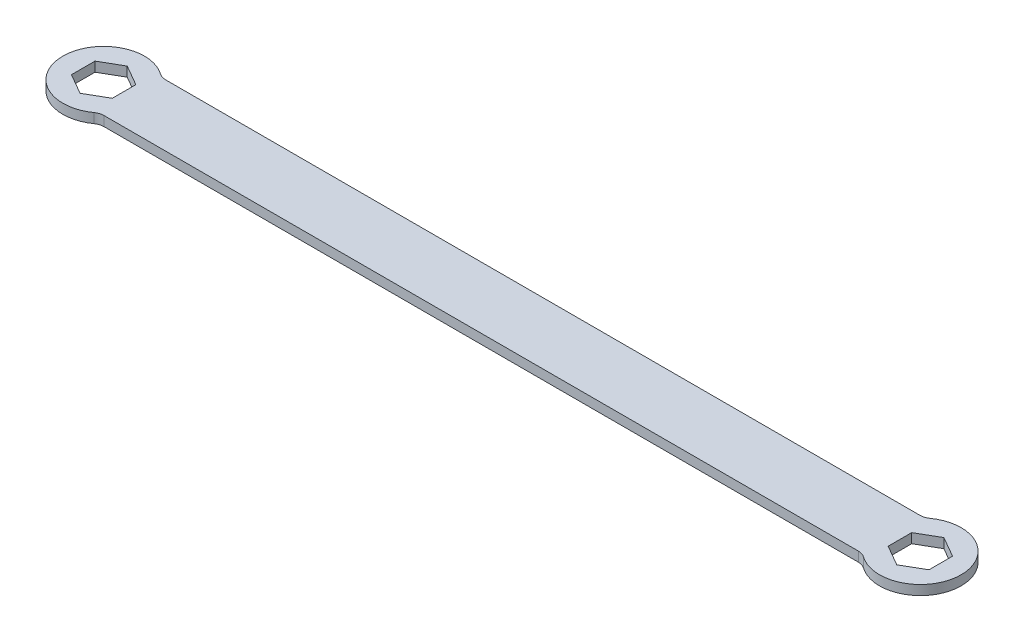
ISO-10303-21;
HEADER;
FILE_DESCRIPTION(('STEP AP214'),'2;1');
FILE_NAME('part.step','',(''),(''),'','','');
FILE_SCHEMA(('AUTOMOTIVE_DESIGN { 1 0 10303 214 1 1 1 1 }'));
ENDSEC;
DATA;
#1=APPLICATION_CONTEXT('core data for automotive mechanical design processes');
#2=APPLICATION_PROTOCOL_DEFINITION('international standard','automotive_design',2000,#1);
#3=PRODUCT_CONTEXT('',#1,'mechanical');
#4=PRODUCT('Part','Part','',(#3));
#5=PRODUCT_RELATED_PRODUCT_CATEGORY('part','',(#4));
#6=PRODUCT_DEFINITION_FORMATION('','',#4);
#7=PRODUCT_DEFINITION_CONTEXT('part definition',#1,'design');
#8=PRODUCT_DEFINITION('design','',#6,#7);
#9=PRODUCT_DEFINITION_SHAPE('','',#8);
#10=(LENGTH_UNIT() NAMED_UNIT(*) SI_UNIT(.MILLI.,.METRE.));
#11=(NAMED_UNIT(*) PLANE_ANGLE_UNIT() SI_UNIT($,.RADIAN.));
#12=(NAMED_UNIT(*) SI_UNIT($,.STERADIAN.) SOLID_ANGLE_UNIT());
#13=UNCERTAINTY_MEASURE_WITH_UNIT(LENGTH_MEASURE(1.E-05),#10,'distance_accuracy_value','');
#14=(GEOMETRIC_REPRESENTATION_CONTEXT(3) GLOBAL_UNCERTAINTY_ASSIGNED_CONTEXT((#13)) GLOBAL_UNIT_ASSIGNED_CONTEXT((#10,
#11,#12)) REPRESENTATION_CONTEXT('',''));
#15=CARTESIAN_POINT('',(0.,0.,0.));
#16=DIRECTION('',(0.,0.,1.));
#17=DIRECTION('',(1.,0.,0.));
#18=AXIS2_PLACEMENT_3D('',#15,#16,#17);
#19=CARTESIAN_POINT('',(-60.3322226305552,0.75,0.));
#20=DIRECTION('',(-1.,0.,0.));
#21=DIRECTION('',(0.,0.,1.));
#22=AXIS2_PLACEMENT_3D('',#19,#20,#21);
#23=PLANE('',#22);
#24=DIRECTION('',(0.,0.,-1.));
#25=VECTOR('',#24,1.);
#26=CARTESIAN_POINT('',(-60.3322226305552,-0.75,0.));
#27=LINE('',#26,#25);
#28=CARTESIAN_POINT('',(-60.3322226305552,-0.75,1.83308710467706));
#29=VERTEX_POINT('',#28);
#30=CARTESIAN_POINT('',(-60.3322226305552,-0.75,-1.83308710467706));
#31=VERTEX_POINT('',#30);
#32=EDGE_CURVE('E308',#29,#31,#27,.T.);
#33=ORIENTED_EDGE('',*,*,#32,.F.);
#34=DIRECTION('',(0.,-1.,0.));
#35=VECTOR('',#34,1.);
#36=CARTESIAN_POINT('',(-60.3322226305552,0.75,1.83308710467706));
#37=LINE('',#36,#35);
#38=CARTESIAN_POINT('',(-60.3322226305552,0.75,1.83308710467706));
#39=VERTEX_POINT('',#38);
#40=EDGE_CURVE('E347',#39,#29,#37,.T.);
#41=ORIENTED_EDGE('',*,*,#40,.F.);
#42=DIRECTION('',(0.,0.,-1.));
#43=VECTOR('',#42,1.);
#44=CARTESIAN_POINT('',(-60.3322226305552,0.75,0.));
#45=LINE('',#44,#43);
#46=CARTESIAN_POINT('',(-60.3322226305552,0.75,-1.83308710467706));
#47=VERTEX_POINT('',#46);
#48=EDGE_CURVE('E246',#39,#47,#45,.T.);
#49=ORIENTED_EDGE('',*,*,#48,.T.);
#50=DIRECTION('',(0.,-1.,0.));
#51=VECTOR('',#50,1.);
#52=CARTESIAN_POINT('',(-60.3322226305552,0.75,-1.83308710467706));
#53=LINE('',#52,#51);
#54=EDGE_CURVE('E210',#47,#31,#53,.T.);
#55=ORIENTED_EDGE('',*,*,#54,.T.);
#56=EDGE_LOOP('',(#33,#41,#49,#55));
#57=FACE_BOUND('',#56,.T.);
#58=ADVANCED_FACE('F15',(#57),#23,.T.);
#59=CARTESIAN_POINT('',(-14.2893056576388,0.75,-24.7498034039118));
#60=DIRECTION('',(-0.5,0.,-0.866025403784438));
#61=DIRECTION('',(-0.866025403784439,0.,0.5));
#62=AXIS2_PLACEMENT_3D('',#59,#60,#61);
#63=PLANE('',#62);
#64=DIRECTION('',(0.866025403784439,0.,-0.5));
#65=VECTOR('',#64,1.);
#66=CARTESIAN_POINT('',(-14.2893056576388,-0.75,-24.7498034039118));
#67=LINE('',#66,#65);
#68=CARTESIAN_POINT('',(-63.5072226305552,-0.75,3.66617420935412));
#69=VERTEX_POINT('',#68);
#70=EDGE_CURVE('E312',#69,#29,#67,.T.);
#71=ORIENTED_EDGE('',*,*,#70,.F.);
#72=DIRECTION('',(0.,-1.,0.));
#73=VECTOR('',#72,1.);
#74=CARTESIAN_POINT('',(-63.5072226305552,0.75,3.66617420935412));
#75=LINE('',#74,#73);
#76=CARTESIAN_POINT('',(-63.5072226305552,0.75,3.66617420935412));
#77=VERTEX_POINT('',#76);
#78=EDGE_CURVE('E344',#77,#69,#75,.T.);
#79=ORIENTED_EDGE('',*,*,#78,.F.);
#80=DIRECTION('',(0.866025403784439,0.,-0.5));
#81=VECTOR('',#80,1.);
#82=CARTESIAN_POINT('',(-14.2893056576388,0.75,-24.7498034039118));
#83=LINE('',#82,#81);
#84=EDGE_CURVE('E250',#77,#39,#83,.T.);
#85=ORIENTED_EDGE('',*,*,#84,.T.);
#86=ORIENTED_EDGE('',*,*,#40,.T.);
#87=EDGE_LOOP('',(#71,#79,#85,#86));
#88=FACE_BOUND('',#87,.T.);
#89=ADVANCED_FACE('F463',(#88),#63,.T.);
#90=CARTESIAN_POINT('',(-17.4643056576388,0.75,30.249064717943));
#91=DIRECTION('',(0.500000000000001,0.,-0.866025403784438));
#92=DIRECTION('',(-0.866025403784438,0.,-0.500000000000001));
#93=AXIS2_PLACEMENT_3D('',#90,#91,#92);
#94=PLANE('',#93);
#95=DIRECTION('',(0.866025403784438,0.,0.500000000000001));
#96=VECTOR('',#95,1.);
#97=CARTESIAN_POINT('',(-17.4643056576388,-0.75,30.249064717943));
#98=LINE('',#97,#96);
#99=CARTESIAN_POINT('',(-66.6822226305552,-0.75,1.83308710467705));
#100=VERTEX_POINT('',#99);
#101=EDGE_CURVE('E316',#100,#69,#98,.T.);
#102=ORIENTED_EDGE('',*,*,#101,.F.);
#103=DIRECTION('',(0.,-1.,0.));
#104=VECTOR('',#103,1.);
#105=CARTESIAN_POINT('',(-66.6822226305552,0.75,1.83308710467705));
#106=LINE('',#105,#104);
#107=CARTESIAN_POINT('',(-66.6822226305552,0.75,1.83308710467705));
#108=VERTEX_POINT('',#107);
#109=EDGE_CURVE('E341',#108,#100,#106,.T.);
#110=ORIENTED_EDGE('',*,*,#109,.F.);
#111=DIRECTION('',(0.866025403784438,0.,0.500000000000001));
#112=VECTOR('',#111,1.);
#113=CARTESIAN_POINT('',(-17.4643056576388,0.75,30.249064717943));
#114=LINE('',#113,#112);
#115=EDGE_CURVE('E254',#108,#77,#114,.T.);
#116=ORIENTED_EDGE('',*,*,#115,.T.);
#117=ORIENTED_EDGE('',*,*,#78,.T.);
#118=EDGE_LOOP('',(#102,#110,#116,#117));
#119=FACE_BOUND('',#118,.T.);
#120=ADVANCED_FACE('F469',(#119),#94,.T.);
#121=CARTESIAN_POINT('',(-66.6822226305552,0.75,0.));
#122=DIRECTION('',(1.,0.,0.));
#123=DIRECTION('',(0.,0.,-1.));
#124=AXIS2_PLACEMENT_3D('',#121,#122,#123);
#125=PLANE('',#124);
#126=DIRECTION('',(0.,0.,1.));
#127=VECTOR('',#126,1.);
#128=CARTESIAN_POINT('',(-66.6822226305552,-0.75,0.));
#129=LINE('',#128,#127);
#130=CARTESIAN_POINT('',(-66.6822226305552,-0.75,-1.83308710467706));
#131=VERTEX_POINT('',#130);
#132=EDGE_CURVE('E320',#131,#100,#129,.T.);
#133=ORIENTED_EDGE('',*,*,#132,.F.);
#134=DIRECTION('',(0.,-1.,0.));
#135=VECTOR('',#134,1.);
#136=CARTESIAN_POINT('',(-66.6822226305552,0.75,-1.83308710467706));
#137=LINE('',#136,#135);
#138=CARTESIAN_POINT('',(-66.6822226305552,0.75,-1.83308710467706));
#139=VERTEX_POINT('',#138);
#140=EDGE_CURVE('E338',#139,#131,#137,.T.);
#141=ORIENTED_EDGE('',*,*,#140,.F.);
#142=DIRECTION('',(0.,0.,1.));
#143=VECTOR('',#142,1.);
#144=CARTESIAN_POINT('',(-66.6822226305552,0.75,0.));
#145=LINE('',#144,#143);
#146=EDGE_CURVE('E258',#139,#108,#145,.T.);
#147=ORIENTED_EDGE('',*,*,#146,.T.);
#148=ORIENTED_EDGE('',*,*,#109,.T.);
#149=EDGE_LOOP('',(#133,#141,#147,#148));
#150=FACE_BOUND('',#149,.T.);
#151=ADVANCED_FACE('F520',(#150),#125,.T.);
#152=CARTESIAN_POINT('',(-17.4643056576388,0.75,-30.249064717943));
#153=DIRECTION('',(0.500000000000001,0.,0.866025403784438));
#154=DIRECTION('',(0.866025403784438,0.,-0.500000000000001));
#155=AXIS2_PLACEMENT_3D('',#152,#153,#154);
#156=PLANE('',#155);
#157=DIRECTION('',(-0.866025403784438,0.,0.5));
#158=VECTOR('',#157,1.);
#159=CARTESIAN_POINT('',(-17.4643056576388,-0.75,-30.249064717943));
#160=LINE('',#159,#158);
#161=CARTESIAN_POINT('',(-63.5072226305552,-0.75,-3.66617420935413));
#162=VERTEX_POINT('',#161);
#163=EDGE_CURVE('E324',#162,#131,#160,.T.);
#164=ORIENTED_EDGE('',*,*,#163,.F.);
#165=DIRECTION('',(0.,-1.,0.));
#166=VECTOR('',#165,1.);
#167=CARTESIAN_POINT('',(-63.5072226305552,0.75,-3.66617420935413));
#168=LINE('',#167,#166);
#169=CARTESIAN_POINT('',(-63.5072226305552,0.75,-3.66617420935413));
#170=VERTEX_POINT('',#169);
#171=EDGE_CURVE('E335',#170,#162,#168,.T.);
#172=ORIENTED_EDGE('',*,*,#171,.F.);
#173=DIRECTION('',(-0.866025403784438,0.,0.5));
#174=VECTOR('',#173,1.);
#175=CARTESIAN_POINT('',(-17.4643056576388,0.75,-30.249064717943));
#176=LINE('',#175,#174);
#177=EDGE_CURVE('E262',#170,#139,#176,.T.);
#178=ORIENTED_EDGE('',*,*,#177,.T.);
#179=ORIENTED_EDGE('',*,*,#140,.T.);
#180=EDGE_LOOP('',(#164,#172,#178,#179));
#181=FACE_BOUND('',#180,.T.);
#182=ADVANCED_FACE('F495',(#181),#156,.T.);
#183=CARTESIAN_POINT('',(14.2893056576388,0.75,-24.7498034039118));
#184=DIRECTION('',(0.5,0.,-0.866025403784439));
#185=DIRECTION('',(-0.866025403784439,0.,-0.5));
#186=AXIS2_PLACEMENT_3D('',#183,#184,#185);
#187=PLANE('',#186);
#188=DIRECTION('',(0.866025403784439,0.,0.5));
#189=VECTOR('',#188,1.);
#190=CARTESIAN_POINT('',(14.2893056576388,-0.75,-24.7498034039118));
#191=LINE('',#190,#189);
#192=CARTESIAN_POINT('',(60.3322226305552,-0.75,1.83308710467706));
#193=VERTEX_POINT('',#192);
#194=CARTESIAN_POINT('',(63.5072226305552,-0.75,3.66617420935414));
#195=VERTEX_POINT('',#194);
#196=EDGE_CURVE('E204',#193,#195,#191,.T.);
#197=ORIENTED_EDGE('',*,*,#196,.F.);
#198=DIRECTION('',(0.,-1.,0.));
#199=VECTOR('',#198,1.);
#200=CARTESIAN_POINT('',(60.3322226305552,0.75,1.83308710467706));
#201=LINE('',#200,#199);
#202=CARTESIAN_POINT('',(60.3322226305552,0.75,1.83308710467706));
#203=VERTEX_POINT('',#202);
#204=EDGE_CURVE('E198',#203,#193,#201,.T.);
#205=ORIENTED_EDGE('',*,*,#204,.F.);
#206=DIRECTION('',(0.866025403784439,0.,0.5));
#207=VECTOR('',#206,1.);
#208=CARTESIAN_POINT('',(14.2893056576388,0.75,-24.7498034039118));
#209=LINE('',#208,#207);
#210=CARTESIAN_POINT('',(63.5072226305552,0.75,3.66617420935414));
#211=VERTEX_POINT('',#210);
#212=EDGE_CURVE('E201',#203,#211,#209,.T.);
#213=ORIENTED_EDGE('',*,*,#212,.T.);
#214=DIRECTION('',(0.,-1.,0.));
#215=VECTOR('',#214,1.);
#216=CARTESIAN_POINT('',(63.5072226305552,0.75,3.66617420935414));
#217=LINE('',#216,#215);
#218=EDGE_CURVE('E270',#211,#195,#217,.T.);
#219=ORIENTED_EDGE('',*,*,#218,.T.);
#220=EDGE_LOOP('',(#197,#205,#213,#219));
#221=FACE_BOUND('',#220,.T.);
#222=ADVANCED_FACE('F200',(#221),#187,.T.);
#223=CARTESIAN_POINT('',(60.3322226305552,0.75,0.));
#224=DIRECTION('',(1.,0.,0.));
#225=DIRECTION('',(0.,0.,-1.));
#226=AXIS2_PLACEMENT_3D('',#223,#224,#225);
#227=PLANE('',#226);
#228=DIRECTION('',(0.,0.,1.));
#229=VECTOR('',#228,1.);
#230=CARTESIAN_POINT('',(60.3322226305552,-0.75,0.));
#231=LINE('',#230,#229);
#232=CARTESIAN_POINT('',(60.3322226305552,-0.75,-1.83308710467705));
#233=VERTEX_POINT('',#232);
#234=EDGE_CURVE('E289',#233,#193,#231,.T.);
#235=ORIENTED_EDGE('',*,*,#234,.F.);
#236=DIRECTION('',(0.,-1.,0.));
#237=VECTOR('',#236,1.);
#238=CARTESIAN_POINT('',(60.3322226305552,0.75,-1.83308710467705));
#239=LINE('',#238,#237);
#240=CARTESIAN_POINT('',(60.3322226305552,0.75,-1.83308710467705));
#241=VERTEX_POINT('',#240);
#242=EDGE_CURVE('E211',#241,#233,#239,.T.);
#243=ORIENTED_EDGE('',*,*,#242,.F.);
#244=DIRECTION('',(0.,0.,1.));
#245=VECTOR('',#244,1.);
#246=CARTESIAN_POINT('',(60.3322226305552,0.75,0.));
#247=LINE('',#246,#245);
#248=EDGE_CURVE('E218',#241,#203,#247,.T.);
#249=ORIENTED_EDGE('',*,*,#248,.T.);
#250=ORIENTED_EDGE('',*,*,#204,.T.);
#251=EDGE_LOOP('',(#235,#243,#249,#250));
#252=FACE_BOUND('',#251,.T.);
#253=ADVANCED_FACE('F226',(#252),#227,.T.);
#254=CARTESIAN_POINT('',(14.2893056576388,0.75,24.7498034039118));
#255=DIRECTION('',(0.500000000000001,0.,0.866025403784438));
#256=DIRECTION('',(0.866025403784438,0.,-0.500000000000001));
#257=AXIS2_PLACEMENT_3D('',#254,#255,#256);
#258=PLANE('',#257);
#259=DIRECTION('',(-0.866025403784438,0.,0.500000000000001));
#260=VECTOR('',#259,1.);
#261=CARTESIAN_POINT('',(14.2893056576388,-0.75,24.7498034039118));
#262=LINE('',#261,#260);
#263=CARTESIAN_POINT('',(63.5072226305552,-0.75,-3.6661742093541));
#264=VERTEX_POINT('',#263);
#265=EDGE_CURVE('E292',#264,#233,#262,.T.);
#266=ORIENTED_EDGE('',*,*,#265,.F.);
#267=DIRECTION('',(0.,-1.,0.));
#268=VECTOR('',#267,1.);
#269=CARTESIAN_POINT('',(63.5072226305552,0.75,-3.6661742093541));
#270=LINE('',#269,#268);
#271=CARTESIAN_POINT('',(63.5072226305552,0.75,-3.6661742093541));
#272=VERTEX_POINT('',#271);
#273=EDGE_CURVE('E359',#272,#264,#270,.T.);
#274=ORIENTED_EDGE('',*,*,#273,.F.);
#275=DIRECTION('',(-0.866025403784438,0.,0.500000000000001));
#276=VECTOR('',#275,1.);
#277=CARTESIAN_POINT('',(14.2893056576388,0.75,24.7498034039118));
#278=LINE('',#277,#276);
#279=EDGE_CURVE('E228',#272,#241,#278,.T.);
#280=ORIENTED_EDGE('',*,*,#279,.T.);
#281=ORIENTED_EDGE('',*,*,#242,.T.);
#282=EDGE_LOOP('',(#266,#274,#280,#281));
#283=FACE_BOUND('',#282,.T.);
#284=ADVANCED_FACE('F486',(#283),#258,.T.);
#285=CARTESIAN_POINT('',(17.4643056576387,0.75,-30.2490647179429));
#286=DIRECTION('',(-0.499999999999999,0.,0.866025403784439));
#287=DIRECTION('',(0.866025403784439,0.,0.499999999999999));
#288=AXIS2_PLACEMENT_3D('',#285,#286,#287);
#289=PLANE('',#288);
#290=DIRECTION('',(-0.866025403784439,0.,-0.499999999999999));
#291=VECTOR('',#290,1.);
#292=CARTESIAN_POINT('',(17.4643056576387,-0.75,-30.2490647179429));
#293=LINE('',#292,#291);
#294=CARTESIAN_POINT('',(66.6822226305552,-0.75,-1.83308710467705));
#295=VERTEX_POINT('',#294);
#296=EDGE_CURVE('E296',#295,#264,#293,.T.);
#297=ORIENTED_EDGE('',*,*,#296,.F.);
#298=DIRECTION('',(0.,-1.,0.));
#299=VECTOR('',#298,1.);
#300=CARTESIAN_POINT('',(66.6822226305552,0.75,-1.83308710467705));
#301=LINE('',#300,#299);
#302=CARTESIAN_POINT('',(66.6822226305552,0.75,-1.83308710467705));
#303=VERTEX_POINT('',#302);
#304=EDGE_CURVE('E356',#303,#295,#301,.T.);
#305=ORIENTED_EDGE('',*,*,#304,.F.);
#306=DIRECTION('',(-0.866025403784439,0.,-0.499999999999999));
#307=VECTOR('',#306,1.);
#308=CARTESIAN_POINT('',(17.4643056576387,0.75,-30.2490647179429));
#309=LINE('',#308,#307);
#310=EDGE_CURVE('E233',#303,#272,#309,.T.);
#311=ORIENTED_EDGE('',*,*,#310,.T.);
#312=ORIENTED_EDGE('',*,*,#273,.T.);
#313=EDGE_LOOP('',(#297,#305,#311,#312));
#314=FACE_BOUND('',#313,.T.);
#315=ADVANCED_FACE('F482',(#314),#289,.T.);
#316=CARTESIAN_POINT('',(66.6822226305552,0.75,0.));
#317=DIRECTION('',(-1.,0.,0.));
#318=DIRECTION('',(0.,0.,1.));
#319=AXIS2_PLACEMENT_3D('',#316,#317,#318);
#320=PLANE('',#319);
#321=DIRECTION('',(0.,0.,-1.));
#322=VECTOR('',#321,1.);
#323=CARTESIAN_POINT('',(66.6822226305552,-0.75,0.));
#324=LINE('',#323,#322);
#325=CARTESIAN_POINT('',(66.6822226305552,-0.75,1.83308710467707));
#326=VERTEX_POINT('',#325);
#327=EDGE_CURVE('E300',#326,#295,#324,.T.);
#328=ORIENTED_EDGE('',*,*,#327,.F.);
#329=DIRECTION('',(0.,-1.,0.));
#330=VECTOR('',#329,1.);
#331=CARTESIAN_POINT('',(66.6822226305552,0.75,1.83308710467707));
#332=LINE('',#331,#330);
#333=CARTESIAN_POINT('',(66.6822226305552,0.75,1.83308710467707));
#334=VERTEX_POINT('',#333);
#335=EDGE_CURVE('E353',#334,#326,#332,.T.);
#336=ORIENTED_EDGE('',*,*,#335,.F.);
#337=DIRECTION('',(0.,0.,-1.));
#338=VECTOR('',#337,1.);
#339=CARTESIAN_POINT('',(66.6822226305552,0.75,0.));
#340=LINE('',#339,#338);
#341=EDGE_CURVE('E240',#334,#303,#340,.T.);
#342=ORIENTED_EDGE('',*,*,#341,.T.);
#343=ORIENTED_EDGE('',*,*,#304,.T.);
#344=EDGE_LOOP('',(#328,#336,#342,#343));
#345=FACE_BOUND('',#344,.T.);
#346=ADVANCED_FACE('F479',(#345),#320,.T.);
#347=CARTESIAN_POINT('',(63.5072226305552,0.75,0.));
#348=DIRECTION('',(0.,-1.,0.));
#349=DIRECTION('',(0.,0.,-1.));
#350=AXIS2_PLACEMENT_3D('',#347,#348,#349);
#351=CYLINDRICAL_SURFACE('',#350,6.35);
#352=CARTESIAN_POINT('',(63.5072226305552,-0.75,0.));
#353=DIRECTION('',(0.,1.,0.));
#354=DIRECTION('',(0.,0.,1.));
#355=AXIS2_PLACEMENT_3D('',#352,#353,#354);
#356=CIRCLE('',#355,6.35);
#357=CARTESIAN_POINT('',(59.8220366076356,-0.75,-5.17125748502994));
#358=VERTEX_POINT('',#357);
#359=CARTESIAN_POINT('',(59.8220366076356,-0.75,5.17125748502994));
#360=VERTEX_POINT('',#359);
#361=EDGE_CURVE('E271',#358,#360,#356,.F.);
#362=ORIENTED_EDGE('',*,*,#361,.F.);
#363=DIRECTION('',(0.,-1.,0.));
#364=VECTOR('',#363,1.);
#365=CARTESIAN_POINT('',(59.8220366076356,0.75,-5.17125748502994));
#366=LINE('',#365,#364);
#367=CARTESIAN_POINT('',(59.8220366076356,0.75,-5.17125748502994));
#368=VERTEX_POINT('',#367);
#369=EDGE_CURVE('E43',#358,#368,#366,.F.);
#370=ORIENTED_EDGE('',*,*,#369,.T.);
#371=CARTESIAN_POINT('',(63.5072226305552,0.75,0.));
#372=DIRECTION('',(0.,1.,0.));
#373=DIRECTION('',(0.,0.,1.));
#374=AXIS2_PLACEMENT_3D('',#371,#372,#373);
#375=CIRCLE('',#374,6.35);
#376=CARTESIAN_POINT('',(59.8220366076356,0.75,5.17125748502994));
#377=VERTEX_POINT('',#376);
#378=EDGE_CURVE('E332',#368,#377,#375,.F.);
#379=ORIENTED_EDGE('',*,*,#378,.T.);
#380=DIRECTION('',(0.,-1.,0.));
#381=VECTOR('',#380,1.);
#382=CARTESIAN_POINT('',(59.8220366076356,0.75,5.17125748502994));
#383=LINE('',#382,#381);
#384=EDGE_CURVE('E384',#377,#360,#383,.T.);
#385=ORIENTED_EDGE('',*,*,#384,.T.);
#386=EDGE_LOOP('',(#362,#370,#379,#385));
#387=FACE_BOUND('',#386,.T.);
#388=ADVANCED_FACE('F420',(#387),#351,.T.);
#389=CARTESIAN_POINT('',(0.,0.75,-4.8));
#390=DIRECTION('',(0.,0.,-1.));
#391=DIRECTION('',(-1.,0.,0.));
#392=AXIS2_PLACEMENT_3D('',#389,#390,#391);
#393=PLANE('',#392);
#394=DIRECTION('',(1.,0.,0.));
#395=VECTOR('',#394,1.);
#396=CARTESIAN_POINT('',(0.,-0.75,-4.8));
#397=LINE('',#396,#395);
#398=CARTESIAN_POINT('',(-58.6613480964798,-0.75,-4.8));
#399=VERTEX_POINT('',#398);
#400=CARTESIAN_POINT('',(58.6613480964798,-0.75,-4.8));
#401=VERTEX_POINT('',#400);
#402=EDGE_CURVE('E275',#399,#401,#397,.T.);
#403=ORIENTED_EDGE('',*,*,#402,.F.);
#404=DIRECTION('',(0.,-1.,0.));
#405=VECTOR('',#404,1.);
#406=CARTESIAN_POINT('',(-58.6613480964798,0.75,-4.8));
#407=LINE('',#406,#405);
#408=CARTESIAN_POINT('',(-58.6613480964798,0.75,-4.8));
#409=VERTEX_POINT('',#408);
#410=EDGE_CURVE('E381',#399,#409,#407,.F.);
#411=ORIENTED_EDGE('',*,*,#410,.T.);
#412=DIRECTION('',(1.,0.,0.));
#413=VECTOR('',#412,1.);
#414=CARTESIAN_POINT('',(0.,0.75,-4.8));
#415=LINE('',#414,#413);
#416=CARTESIAN_POINT('',(58.6613480964798,0.75,-4.8));
#417=VERTEX_POINT('',#416);
#418=EDGE_CURVE('E423',#409,#417,#415,.T.);
#419=ORIENTED_EDGE('',*,*,#418,.T.);
#420=DIRECTION('',(0.,1.,0.));
#421=VECTOR('',#420,1.);
#422=CARTESIAN_POINT('',(58.6613480964798,-0.75,-4.8));
#423=LINE('',#422,#421);
#424=EDGE_CURVE('E377',#417,#401,#423,.F.);
#425=ORIENTED_EDGE('',*,*,#424,.T.);
#426=EDGE_LOOP('',(#403,#411,#419,#425));
#427=FACE_BOUND('',#426,.T.);
#428=ADVANCED_FACE('F450',(#427),#393,.T.);
#429=CARTESIAN_POINT('',(-63.5072226305552,0.75,0.));
#430=DIRECTION('',(0.,-1.,0.));
#431=DIRECTION('',(0.,0.,-1.));
#432=AXIS2_PLACEMENT_3D('',#429,#430,#431);
#433=CYLINDRICAL_SURFACE('',#432,6.35);
#434=CARTESIAN_POINT('',(-63.5072226305552,-0.75,0.));
#435=DIRECTION('',(0.,1.,0.));
#436=DIRECTION('',(0.,0.,1.));
#437=AXIS2_PLACEMENT_3D('',#434,#435,#436);
#438=CIRCLE('',#437,6.35);
#439=CARTESIAN_POINT('',(-59.8220366076356,-0.75,-5.17125748502994));
#440=VERTEX_POINT('',#439);
#441=CARTESIAN_POINT('',(-59.8220366076356,-0.75,5.17125748502994));
#442=VERTEX_POINT('',#441);
#443=EDGE_CURVE('E279',#440,#442,#438,.T.);
#444=ORIENTED_EDGE('',*,*,#443,.T.);
#445=DIRECTION('',(0.,-1.,0.));
#446=VECTOR('',#445,1.);
#447=CARTESIAN_POINT('',(-59.8220366076356,0.75,5.17125748502994));
#448=LINE('',#447,#446);
#449=CARTESIAN_POINT('',(-59.8220366076356,0.75,5.17125748502994));
#450=VERTEX_POINT('',#449);
#451=EDGE_CURVE('E374',#442,#450,#448,.F.);
#452=ORIENTED_EDGE('',*,*,#451,.T.);
#453=CARTESIAN_POINT('',(-63.5072226305552,0.75,0.));
#454=DIRECTION('',(0.,1.,0.));
#455=DIRECTION('',(0.,0.,1.));
#456=AXIS2_PLACEMENT_3D('',#453,#454,#455);
#457=CIRCLE('',#456,6.35);
#458=CARTESIAN_POINT('',(-59.8220366076356,0.75,-5.17125748502994));
#459=VERTEX_POINT('',#458);
#460=EDGE_CURVE('E428',#459,#450,#457,.T.);
#461=ORIENTED_EDGE('',*,*,#460,.F.);
#462=DIRECTION('',(0.,-1.,0.));
#463=VECTOR('',#462,1.);
#464=CARTESIAN_POINT('',(-59.8220366076356,0.75,-5.17125748502994));
#465=LINE('',#464,#463);
#466=EDGE_CURVE('E370',#459,#440,#465,.T.);
#467=ORIENTED_EDGE('',*,*,#466,.T.);
#468=EDGE_LOOP('',(#444,#452,#461,#467));
#469=FACE_BOUND('',#468,.T.);
#470=ADVANCED_FACE('F441',(#469),#433,.T.);
#471=CARTESIAN_POINT('',(17.464305657639,0.75,30.2490647179431));
#472=DIRECTION('',(-0.500000000000004,0.,-0.866025403784436));
#473=DIRECTION('',(-0.866025403784437,0.,0.500000000000004));
#474=AXIS2_PLACEMENT_3D('',#471,#472,#473);
#475=PLANE('',#474);
#476=DIRECTION('',(0.866025403784437,0.,-0.500000000000004));
#477=VECTOR('',#476,1.);
#478=CARTESIAN_POINT('',(17.464305657639,-0.75,30.2490647179431));
#479=LINE('',#478,#477);
#480=EDGE_CURVE('E304',#195,#326,#479,.T.);
#481=ORIENTED_EDGE('',*,*,#480,.F.);
#482=ORIENTED_EDGE('',*,*,#218,.F.);
#483=DIRECTION('',(0.866025403784437,0.,-0.500000000000004));
#484=VECTOR('',#483,1.);
#485=CARTESIAN_POINT('',(17.464305657639,0.75,30.2490647179431));
#486=LINE('',#485,#484);
#487=EDGE_CURVE('E222',#211,#334,#486,.T.);
#488=ORIENTED_EDGE('',*,*,#487,.T.);
#489=ORIENTED_EDGE('',*,*,#335,.T.);
#490=EDGE_LOOP('',(#481,#482,#488,#489));
#491=FACE_BOUND('',#490,.T.);
#492=ADVANCED_FACE('F475',(#491),#475,.T.);
#493=CARTESIAN_POINT('',(0.,0.75,4.8));
#494=DIRECTION('',(0.,0.,-1.));
#495=DIRECTION('',(-1.,0.,0.));
#496=AXIS2_PLACEMENT_3D('',#493,#494,#495);
#497=PLANE('',#496);
#498=DIRECTION('',(1.,0.,0.));
#499=VECTOR('',#498,1.);
#500=CARTESIAN_POINT('',(0.,0.75,4.8));
#501=LINE('',#500,#499);
#502=CARTESIAN_POINT('',(-58.6613480964798,0.75,4.8));
#503=VERTEX_POINT('',#502);
#504=CARTESIAN_POINT('',(58.6613480964798,0.75,4.8));
#505=VERTEX_POINT('',#504);
#506=EDGE_CURVE('E224',#503,#505,#501,.T.);
#507=ORIENTED_EDGE('',*,*,#506,.F.);
#508=DIRECTION('',(0.,1.,0.));
#509=VECTOR('',#508,1.);
#510=CARTESIAN_POINT('',(-58.6613480964798,-0.75,4.8));
#511=LINE('',#510,#509);
#512=CARTESIAN_POINT('',(-58.6613480964798,-0.75,4.8));
#513=VERTEX_POINT('',#512);
#514=EDGE_CURVE('E366',#503,#513,#511,.F.);
#515=ORIENTED_EDGE('',*,*,#514,.T.);
#516=DIRECTION('',(1.,0.,0.));
#517=VECTOR('',#516,1.);
#518=CARTESIAN_POINT('',(0.,-0.75,4.8));
#519=LINE('',#518,#517);
#520=CARTESIAN_POINT('',(58.6613480964798,-0.75,4.8));
#521=VERTEX_POINT('',#520);
#522=EDGE_CURVE('E283',#513,#521,#519,.T.);
#523=ORIENTED_EDGE('',*,*,#522,.T.);
#524=DIRECTION('',(0.,-1.,0.));
#525=VECTOR('',#524,1.);
#526=CARTESIAN_POINT('',(58.6613480964798,0.75,4.8));
#527=LINE('',#526,#525);
#528=EDGE_CURVE('E350',#521,#505,#527,.F.);
#529=ORIENTED_EDGE('',*,*,#528,.T.);
#530=EDGE_LOOP('',(#507,#515,#523,#529));
#531=FACE_BOUND('',#530,.T.);
#532=ADVANCED_FACE('F418',(#531),#497,.F.);
#533=CARTESIAN_POINT('',(-14.2893056576387,0.75,24.7498034039118));
#534=DIRECTION('',(-0.499999999999999,0.,0.866025403784439));
#535=DIRECTION('',(0.866025403784439,0.,0.499999999999999));
#536=AXIS2_PLACEMENT_3D('',#533,#534,#535);
#537=PLANE('',#536);
#538=DIRECTION('',(-0.866025403784439,0.,-0.499999999999999));
#539=VECTOR('',#538,1.);
#540=CARTESIAN_POINT('',(-14.2893056576387,-0.75,24.7498034039118));
#541=LINE('',#540,#539);
#542=EDGE_CURVE('E328',#31,#162,#541,.T.);
#543=ORIENTED_EDGE('',*,*,#542,.F.);
#544=ORIENTED_EDGE('',*,*,#54,.F.);
#545=DIRECTION('',(-0.866025403784439,0.,-0.499999999999999));
#546=VECTOR('',#545,1.);
#547=CARTESIAN_POINT('',(-14.2893056576387,0.75,24.7498034039118));
#548=LINE('',#547,#546);
#549=EDGE_CURVE('E266',#47,#170,#548,.T.);
#550=ORIENTED_EDGE('',*,*,#549,.T.);
#551=ORIENTED_EDGE('',*,*,#171,.T.);
#552=EDGE_LOOP('',(#543,#544,#550,#551));
#553=FACE_BOUND('',#552,.T.);
#554=ADVANCED_FACE('F498',(#553),#537,.T.);
#555=CARTESIAN_POINT('',(0.,0.75,0.));
#556=DIRECTION('',(0.,1.,0.));
#557=DIRECTION('',(0.,0.,1.));
#558=AXIS2_PLACEMENT_3D('',#555,#556,#557);
#559=PLANE('',#558);
#560=ORIENTED_EDGE('',*,*,#378,.F.);
#561=CARTESIAN_POINT('',(58.6613480964798,0.75,-6.8));
#562=DIRECTION('',(0.,1.,0.));
#563=DIRECTION('',(0.,0.,1.));
#564=AXIS2_PLACEMENT_3D('',#561,#562,#563);
#565=CIRCLE('',#564,2.);
#566=EDGE_CURVE('E405',#368,#417,#565,.F.);
#567=ORIENTED_EDGE('',*,*,#566,.T.);
#568=ORIENTED_EDGE('',*,*,#418,.F.);
#569=CARTESIAN_POINT('',(-58.6613480964798,0.75,-6.8));
#570=DIRECTION('',(0.,1.,0.));
#571=DIRECTION('',(0.,0.,1.));
#572=AXIS2_PLACEMENT_3D('',#569,#570,#571);
#573=CIRCLE('',#572,2.);
#574=EDGE_CURVE('E399',#409,#459,#573,.F.);
#575=ORIENTED_EDGE('',*,*,#574,.T.);
#576=ORIENTED_EDGE('',*,*,#460,.T.);
#577=CARTESIAN_POINT('',(-58.6613480964798,0.75,6.8));
#578=DIRECTION('',(0.,1.,0.));
#579=DIRECTION('',(0.,0.,1.));
#580=AXIS2_PLACEMENT_3D('',#577,#578,#579);
#581=CIRCLE('',#580,2.);
#582=EDGE_CURVE('E393',#450,#503,#581,.F.);
#583=ORIENTED_EDGE('',*,*,#582,.T.);
#584=ORIENTED_EDGE('',*,*,#506,.T.);
#585=CARTESIAN_POINT('',(58.6613480964798,0.75,6.8));
#586=DIRECTION('',(0.,1.,0.));
#587=DIRECTION('',(0.,0.,1.));
#588=AXIS2_PLACEMENT_3D('',#585,#586,#587);
#589=CIRCLE('',#588,2.);
#590=EDGE_CURVE('E10',#505,#377,#589,.F.);
#591=ORIENTED_EDGE('',*,*,#590,.T.);
#592=EDGE_LOOP('',(#560,#567,#568,#575,#576,#583,#584,#591));
#593=FACE_BOUND('',#592,.T.);
#594=ORIENTED_EDGE('',*,*,#212,.F.);
#595=ORIENTED_EDGE('',*,*,#248,.F.);
#596=ORIENTED_EDGE('',*,*,#279,.F.);
#597=ORIENTED_EDGE('',*,*,#310,.F.);
#598=ORIENTED_EDGE('',*,*,#341,.F.);
#599=ORIENTED_EDGE('',*,*,#487,.F.);
#600=EDGE_LOOP('',(#594,#595,#596,#597,#598,#599));
#601=FACE_BOUND('',#600,.T.);
#602=ORIENTED_EDGE('',*,*,#48,.F.);
#603=ORIENTED_EDGE('',*,*,#84,.F.);
#604=ORIENTED_EDGE('',*,*,#115,.F.);
#605=ORIENTED_EDGE('',*,*,#146,.F.);
#606=ORIENTED_EDGE('',*,*,#177,.F.);
#607=ORIENTED_EDGE('',*,*,#549,.F.);
#608=EDGE_LOOP('',(#602,#603,#604,#605,#606,#607));
#609=FACE_BOUND('',#608,.T.);
#610=ADVANCED_FACE('F215',(#593,#601,#609),#559,.T.);
#611=CARTESIAN_POINT('',(0.,-0.75,0.));
#612=DIRECTION('',(0.,1.,0.));
#613=DIRECTION('',(0.,0.,1.));
#614=AXIS2_PLACEMENT_3D('',#611,#612,#613);
#615=PLANE('',#614);
#616=ORIENTED_EDGE('',*,*,#402,.T.);
#617=CARTESIAN_POINT('',(58.6613480964798,-0.75,-6.8));
#618=DIRECTION('',(0.,1.,0.));
#619=DIRECTION('',(0.,0.,1.));
#620=AXIS2_PLACEMENT_3D('',#617,#618,#619);
#621=CIRCLE('',#620,2.);
#622=EDGE_CURVE('E402',#401,#358,#621,.T.);
#623=ORIENTED_EDGE('',*,*,#622,.T.);
#624=ORIENTED_EDGE('',*,*,#361,.T.);
#625=CARTESIAN_POINT('',(58.6613480964798,-0.75,6.8));
#626=DIRECTION('',(0.,1.,0.));
#627=DIRECTION('',(0.,0.,1.));
#628=AXIS2_PLACEMENT_3D('',#625,#626,#627);
#629=CIRCLE('',#628,2.);
#630=EDGE_CURVE('E24',#360,#521,#629,.T.);
#631=ORIENTED_EDGE('',*,*,#630,.T.);
#632=ORIENTED_EDGE('',*,*,#522,.F.);
#633=CARTESIAN_POINT('',(-58.6613480964798,-0.75,6.8));
#634=DIRECTION('',(0.,1.,0.));
#635=DIRECTION('',(0.,0.,1.));
#636=AXIS2_PLACEMENT_3D('',#633,#634,#635);
#637=CIRCLE('',#636,2.);
#638=EDGE_CURVE('E390',#513,#442,#637,.T.);
#639=ORIENTED_EDGE('',*,*,#638,.T.);
#640=ORIENTED_EDGE('',*,*,#443,.F.);
#641=CARTESIAN_POINT('',(-58.6613480964798,-0.75,-6.8));
#642=DIRECTION('',(0.,1.,0.));
#643=DIRECTION('',(0.,0.,1.));
#644=AXIS2_PLACEMENT_3D('',#641,#642,#643);
#645=CIRCLE('',#644,2.);
#646=EDGE_CURVE('E396',#440,#399,#645,.T.);
#647=ORIENTED_EDGE('',*,*,#646,.T.);
#648=EDGE_LOOP('',(#616,#623,#624,#631,#632,#639,#640,#647));
#649=FACE_BOUND('',#648,.T.);
#650=ORIENTED_EDGE('',*,*,#196,.T.);
#651=ORIENTED_EDGE('',*,*,#480,.T.);
#652=ORIENTED_EDGE('',*,*,#327,.T.);
#653=ORIENTED_EDGE('',*,*,#296,.T.);
#654=ORIENTED_EDGE('',*,*,#265,.T.);
#655=ORIENTED_EDGE('',*,*,#234,.T.);
#656=EDGE_LOOP('',(#650,#651,#652,#653,#654,#655));
#657=FACE_BOUND('',#656,.T.);
#658=ORIENTED_EDGE('',*,*,#32,.T.);
#659=ORIENTED_EDGE('',*,*,#542,.T.);
#660=ORIENTED_EDGE('',*,*,#163,.T.);
#661=ORIENTED_EDGE('',*,*,#132,.T.);
#662=ORIENTED_EDGE('',*,*,#101,.T.);
#663=ORIENTED_EDGE('',*,*,#70,.T.);
#664=EDGE_LOOP('',(#658,#659,#660,#661,#662,#663));
#665=FACE_BOUND('',#664,.T.);
#666=ADVANCED_FACE('F411',(#649,#657,#665),#615,.F.);
#667=CARTESIAN_POINT('',(-58.6613480964798,0.75,6.8));
#668=DIRECTION('',(0.,-1.,0.));
#669=DIRECTION('',(0.,0.,-1.));
#670=AXIS2_PLACEMENT_3D('',#667,#668,#669);
#671=CYLINDRICAL_SURFACE('',#670,2.);
#672=ORIENTED_EDGE('',*,*,#582,.F.);
#673=ORIENTED_EDGE('',*,*,#451,.F.);
#674=ORIENTED_EDGE('',*,*,#638,.F.);
#675=ORIENTED_EDGE('',*,*,#514,.F.);
#676=EDGE_LOOP('',(#672,#673,#674,#675));
#677=FACE_BOUND('',#676,.T.);
#678=ADVANCED_FACE('F437',(#677),#671,.F.);
#679=CARTESIAN_POINT('',(-58.6613480964798,0.75,-6.8));
#680=DIRECTION('',(0.,-1.,0.));
#681=DIRECTION('',(0.,0.,-1.));
#682=AXIS2_PLACEMENT_3D('',#679,#680,#681);
#683=CYLINDRICAL_SURFACE('',#682,2.);
#684=ORIENTED_EDGE('',*,*,#574,.F.);
#685=ORIENTED_EDGE('',*,*,#410,.F.);
#686=ORIENTED_EDGE('',*,*,#646,.F.);
#687=ORIENTED_EDGE('',*,*,#466,.F.);
#688=EDGE_LOOP('',(#684,#685,#686,#687));
#689=FACE_BOUND('',#688,.T.);
#690=ADVANCED_FACE('F446',(#689),#683,.F.);
#691=CARTESIAN_POINT('',(58.6613480964798,0.75,-6.8));
#692=DIRECTION('',(0.,-1.,0.));
#693=DIRECTION('',(0.,0.,-1.));
#694=AXIS2_PLACEMENT_3D('',#691,#692,#693);
#695=CYLINDRICAL_SURFACE('',#694,2.);
#696=ORIENTED_EDGE('',*,*,#566,.F.);
#697=ORIENTED_EDGE('',*,*,#369,.F.);
#698=ORIENTED_EDGE('',*,*,#622,.F.);
#699=ORIENTED_EDGE('',*,*,#424,.F.);
#700=EDGE_LOOP('',(#696,#697,#698,#699));
#701=FACE_BOUND('',#700,.T.);
#702=ADVANCED_FACE('F454',(#701),#695,.F.);
#703=CARTESIAN_POINT('',(58.6613480964798,0.75,6.8));
#704=DIRECTION('',(0.,-1.,0.));
#705=DIRECTION('',(0.,0.,-1.));
#706=AXIS2_PLACEMENT_3D('',#703,#704,#705);
#707=CYLINDRICAL_SURFACE('',#706,2.);
#708=ORIENTED_EDGE('',*,*,#590,.F.);
#709=ORIENTED_EDGE('',*,*,#528,.F.);
#710=ORIENTED_EDGE('',*,*,#630,.F.);
#711=ORIENTED_EDGE('',*,*,#384,.F.);
#712=EDGE_LOOP('',(#708,#709,#710,#711));
#713=FACE_BOUND('',#712,.T.);
#714=ADVANCED_FACE('F17',(#713),#707,.F.);
#715=CLOSED_SHELL('',(#58,#89,#120,#151,#182,#222,#253,#284,#315,#346,#388,#428,#470,#492,#532,
#554,#610,#666,#678,#690,#702,#714));
#716=MANIFOLD_SOLID_BREP('B1',#715);
#717=ADVANCED_BREP_SHAPE_REPRESENTATION('',(#18,#716),#14);
#718=SHAPE_DEFINITION_REPRESENTATION(#9,#717);
ENDSEC;
END-ISO-10303-21;
